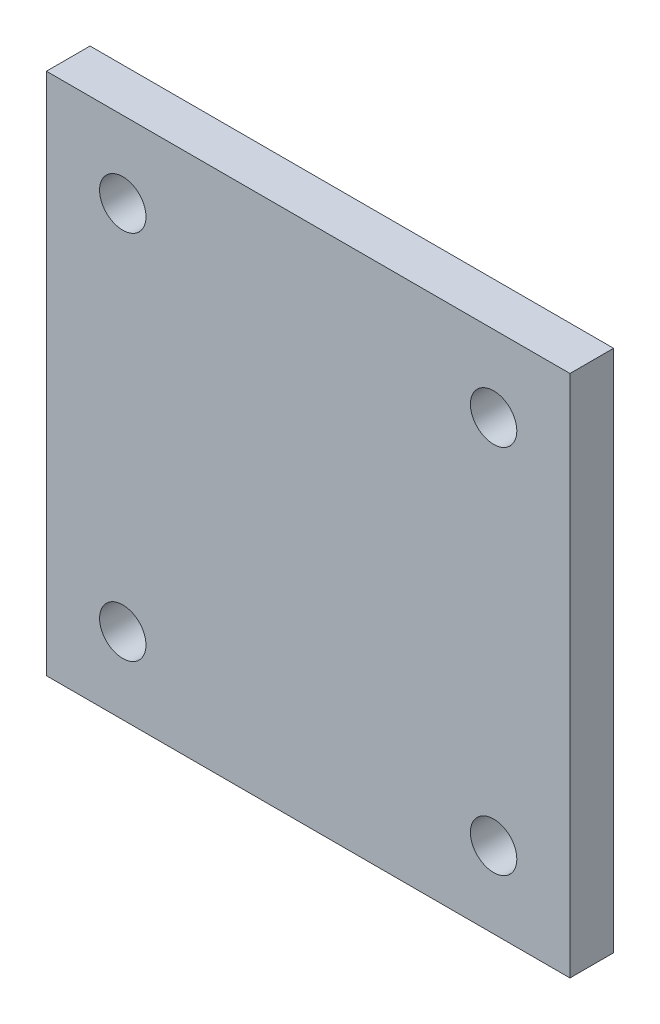
ISO-10303-21;
HEADER;
FILE_DESCRIPTION(('STEP AP214'),'2;1');
FILE_NAME('part.step','',(''),(''),'','','');
FILE_SCHEMA(('AUTOMOTIVE_DESIGN { 1 0 10303 214 1 1 1 1 }'));
ENDSEC;
DATA;
#1=APPLICATION_CONTEXT('core data for automotive mechanical design processes');
#2=APPLICATION_PROTOCOL_DEFINITION('international standard','automotive_design',2000,#1);
#3=PRODUCT_CONTEXT('',#1,'mechanical');
#4=PRODUCT('Part','Part','',(#3));
#5=PRODUCT_RELATED_PRODUCT_CATEGORY('part','',(#4));
#6=PRODUCT_DEFINITION_FORMATION('','',#4);
#7=PRODUCT_DEFINITION_CONTEXT('part definition',#1,'design');
#8=PRODUCT_DEFINITION('design','',#6,#7);
#9=PRODUCT_DEFINITION_SHAPE('','',#8);
#10=(LENGTH_UNIT() NAMED_UNIT(*) SI_UNIT(.MILLI.,.METRE.));
#11=(NAMED_UNIT(*) PLANE_ANGLE_UNIT() SI_UNIT($,.RADIAN.));
#12=(NAMED_UNIT(*) SI_UNIT($,.STERADIAN.) SOLID_ANGLE_UNIT());
#13=UNCERTAINTY_MEASURE_WITH_UNIT(LENGTH_MEASURE(1.E-05),#10,'distance_accuracy_value','');
#14=(GEOMETRIC_REPRESENTATION_CONTEXT(3) GLOBAL_UNCERTAINTY_ASSIGNED_CONTEXT((#13)) GLOBAL_UNIT_ASSIGNED_CONTEXT((#10,
#11,#12)) REPRESENTATION_CONTEXT('',''));
#15=CARTESIAN_POINT('',(0.,0.,0.));
#16=DIRECTION('',(0.,0.,1.));
#17=DIRECTION('',(1.,0.,0.));
#18=AXIS2_PLACEMENT_3D('',#15,#16,#17);
#19=CARTESIAN_POINT('',(38.1,-38.1,6.35));
#20=DIRECTION('',(-1.,0.,0.));
#21=DIRECTION('',(0.,0.,1.));
#22=AXIS2_PLACEMENT_3D('',#19,#20,#21);
#23=PLANE('',#22);
#24=DIRECTION('',(0.,1.,0.));
#25=VECTOR('',#24,1.);
#26=CARTESIAN_POINT('',(38.1,-38.1,0.));
#27=LINE('',#26,#25);
#28=CARTESIAN_POINT('',(38.1,-38.1,0.));
#29=VERTEX_POINT('',#28);
#30=CARTESIAN_POINT('',(38.1,38.1,0.));
#31=VERTEX_POINT('',#30);
#32=EDGE_CURVE('E97',#29,#31,#27,.T.);
#33=ORIENTED_EDGE('',*,*,#32,.T.);
#34=DIRECTION('',(0.,0.,-1.));
#35=VECTOR('',#34,1.);
#36=CARTESIAN_POINT('',(38.1,38.1,6.35));
#37=LINE('',#36,#35);
#38=CARTESIAN_POINT('',(38.1,38.1,6.35));
#39=VERTEX_POINT('',#38);
#40=EDGE_CURVE('E11',#39,#31,#37,.T.);
#41=ORIENTED_EDGE('',*,*,#40,.F.);
#42=DIRECTION('',(0.,1.,0.));
#43=VECTOR('',#42,1.);
#44=CARTESIAN_POINT('',(38.1,-38.1,6.35));
#45=LINE('',#44,#43);
#46=CARTESIAN_POINT('',(38.1,-38.1,6.35));
#47=VERTEX_POINT('',#46);
#48=EDGE_CURVE('E85',#47,#39,#45,.T.);
#49=ORIENTED_EDGE('',*,*,#48,.F.);
#50=DIRECTION('',(0.,0.,-1.));
#51=VECTOR('',#50,1.);
#52=CARTESIAN_POINT('',(38.1,-38.1,6.35));
#53=LINE('',#52,#51);
#54=EDGE_CURVE('E93',#47,#29,#53,.T.);
#55=ORIENTED_EDGE('',*,*,#54,.T.);
#56=EDGE_LOOP('',(#33,#41,#49,#55));
#57=FACE_BOUND('',#56,.T.);
#58=ADVANCED_FACE('F34',(#57),#23,.F.);
#59=CARTESIAN_POINT('',(-38.1,38.1,6.35));
#60=DIRECTION('',(0.,-1.,0.));
#61=DIRECTION('',(0.,0.,-1.));
#62=AXIS2_PLACEMENT_3D('',#59,#60,#61);
#63=PLANE('',#62);
#64=DIRECTION('',(-1.,0.,0.));
#65=VECTOR('',#64,1.);
#66=CARTESIAN_POINT('',(-38.1,38.1,0.));
#67=LINE('',#66,#65);
#68=CARTESIAN_POINT('',(-38.1,38.1,0.));
#69=VERTEX_POINT('',#68);
#70=EDGE_CURVE('E89',#31,#69,#67,.T.);
#71=ORIENTED_EDGE('',*,*,#70,.T.);
#72=DIRECTION('',(0.,0.,-1.));
#73=VECTOR('',#72,1.);
#74=CARTESIAN_POINT('',(-38.1,38.1,6.35));
#75=LINE('',#74,#73);
#76=CARTESIAN_POINT('',(-38.1,38.1,6.35));
#77=VERTEX_POINT('',#76);
#78=EDGE_CURVE('E42',#77,#69,#75,.T.);
#79=ORIENTED_EDGE('',*,*,#78,.F.);
#80=DIRECTION('',(-1.,0.,0.));
#81=VECTOR('',#80,1.);
#82=CARTESIAN_POINT('',(-38.1,38.1,6.35));
#83=LINE('',#82,#81);
#84=EDGE_CURVE('E80',#39,#77,#83,.T.);
#85=ORIENTED_EDGE('',*,*,#84,.F.);
#86=ORIENTED_EDGE('',*,*,#40,.T.);
#87=EDGE_LOOP('',(#71,#79,#85,#86));
#88=FACE_BOUND('',#87,.T.);
#89=ADVANCED_FACE('F88',(#88),#63,.F.);
#90=CARTESIAN_POINT('',(-38.1,-38.1,6.35));
#91=DIRECTION('',(1.,0.,0.));
#92=DIRECTION('',(0.,0.,-1.));
#93=AXIS2_PLACEMENT_3D('',#90,#91,#92);
#94=PLANE('',#93);
#95=DIRECTION('',(0.,-1.,0.));
#96=VECTOR('',#95,1.);
#97=CARTESIAN_POINT('',(-38.1,-38.1,0.));
#98=LINE('',#97,#96);
#99=CARTESIAN_POINT('',(-38.1,-38.1,0.));
#100=VERTEX_POINT('',#99);
#101=EDGE_CURVE('E67',#69,#100,#98,.T.);
#102=ORIENTED_EDGE('',*,*,#101,.T.);
#103=DIRECTION('',(0.,0.,-1.));
#104=VECTOR('',#103,1.);
#105=CARTESIAN_POINT('',(-38.1,-38.1,6.35));
#106=LINE('',#105,#104);
#107=CARTESIAN_POINT('',(-38.1,-38.1,6.35));
#108=VERTEX_POINT('',#107);
#109=EDGE_CURVE('E90',#108,#100,#106,.T.);
#110=ORIENTED_EDGE('',*,*,#109,.F.);
#111=DIRECTION('',(0.,-1.,0.));
#112=VECTOR('',#111,1.);
#113=CARTESIAN_POINT('',(-38.1,-38.1,6.35));
#114=LINE('',#113,#112);
#115=EDGE_CURVE('E83',#77,#108,#114,.T.);
#116=ORIENTED_EDGE('',*,*,#115,.F.);
#117=ORIENTED_EDGE('',*,*,#78,.T.);
#118=EDGE_LOOP('',(#102,#110,#116,#117));
#119=FACE_BOUND('',#118,.T.);
#120=ADVANCED_FACE('F91',(#119),#94,.F.);
#121=CARTESIAN_POINT('',(-38.1,-38.1,6.35));
#122=DIRECTION('',(0.,1.,0.));
#123=DIRECTION('',(0.,0.,1.));
#124=AXIS2_PLACEMENT_3D('',#121,#122,#123);
#125=PLANE('',#124);
#126=DIRECTION('',(1.,0.,0.));
#127=VECTOR('',#126,1.);
#128=CARTESIAN_POINT('',(-38.1,-38.1,0.));
#129=LINE('',#128,#127);
#130=EDGE_CURVE('E73',#100,#29,#129,.T.);
#131=ORIENTED_EDGE('',*,*,#130,.T.);
#132=ORIENTED_EDGE('',*,*,#54,.F.);
#133=DIRECTION('',(1.,0.,0.));
#134=VECTOR('',#133,1.);
#135=CARTESIAN_POINT('',(-38.1,-38.1,6.35));
#136=LINE('',#135,#134);
#137=EDGE_CURVE('E50',#108,#47,#136,.T.);
#138=ORIENTED_EDGE('',*,*,#137,.F.);
#139=ORIENTED_EDGE('',*,*,#109,.T.);
#140=EDGE_LOOP('',(#131,#132,#138,#139));
#141=FACE_BOUND('',#140,.T.);
#142=ADVANCED_FACE('F105',(#141),#125,.F.);
#143=CARTESIAN_POINT('',(38.1,38.1,6.35));
#144=DIRECTION('',(0.,0.,-1.));
#145=DIRECTION('',(-1.,0.,0.));
#146=AXIS2_PLACEMENT_3D('',#143,#144,#145);
#147=PLANE('',#146);
#148=CARTESIAN_POINT('',(-26.9875,26.9875,6.35));
#149=DIRECTION('',(0.,0.,1.));
#150=DIRECTION('',(1.,0.,0.));
#151=AXIS2_PLACEMENT_3D('',#148,#149,#150);
#152=CIRCLE('',#151,3.37819999999999);
#153=CARTESIAN_POINT('',(-23.6093,26.9875,6.35));
#154=VERTEX_POINT('',#153);
#155=EDGE_CURVE('E131',#154,#154,#152,.T.);
#156=ORIENTED_EDGE('',*,*,#155,.F.);
#157=EDGE_LOOP('',(#156));
#158=FACE_BOUND('',#157,.T.);
#159=CARTESIAN_POINT('',(26.9875,26.9875,6.35));
#160=DIRECTION('',(0.,0.,1.));
#161=DIRECTION('',(1.,0.,0.));
#162=AXIS2_PLACEMENT_3D('',#159,#160,#161);
#163=CIRCLE('',#162,3.37819999999999);
#164=CARTESIAN_POINT('',(30.3657,26.9875,6.35));
#165=VERTEX_POINT('',#164);
#166=EDGE_CURVE('E125',#165,#165,#163,.T.);
#167=ORIENTED_EDGE('',*,*,#166,.F.);
#168=EDGE_LOOP('',(#167));
#169=FACE_BOUND('',#168,.T.);
#170=CARTESIAN_POINT('',(26.9875,-26.9875,6.35));
#171=DIRECTION('',(0.,0.,1.));
#172=DIRECTION('',(1.,0.,0.));
#173=AXIS2_PLACEMENT_3D('',#170,#171,#172);
#174=CIRCLE('',#173,3.37819999999999);
#175=CARTESIAN_POINT('',(30.3657,-26.9875,6.35));
#176=VERTEX_POINT('',#175);
#177=EDGE_CURVE('E119',#176,#176,#174,.T.);
#178=ORIENTED_EDGE('',*,*,#177,.F.);
#179=EDGE_LOOP('',(#178));
#180=FACE_BOUND('',#179,.T.);
#181=CARTESIAN_POINT('',(-26.9875,-26.9875,6.35));
#182=DIRECTION('',(0.,0.,1.));
#183=DIRECTION('',(1.,0.,0.));
#184=AXIS2_PLACEMENT_3D('',#181,#182,#183);
#185=CIRCLE('',#184,3.37819999999999);
#186=CARTESIAN_POINT('',(-23.6093,-26.9875,6.35));
#187=VERTEX_POINT('',#186);
#188=EDGE_CURVE('E113',#187,#187,#185,.T.);
#189=ORIENTED_EDGE('',*,*,#188,.F.);
#190=EDGE_LOOP('',(#189));
#191=FACE_BOUND('',#190,.T.);
#192=ORIENTED_EDGE('',*,*,#48,.T.);
#193=ORIENTED_EDGE('',*,*,#84,.T.);
#194=ORIENTED_EDGE('',*,*,#115,.T.);
#195=ORIENTED_EDGE('',*,*,#137,.T.);
#196=EDGE_LOOP('',(#192,#193,#194,#195));
#197=FACE_BOUND('',#196,.T.);
#198=ADVANCED_FACE('F81',(#158,#169,#180,#191,#197),#147,.F.);
#199=CARTESIAN_POINT('',(38.1,38.1,0.));
#200=DIRECTION('',(0.,0.,-1.));
#201=DIRECTION('',(-1.,0.,0.));
#202=AXIS2_PLACEMENT_3D('',#199,#200,#201);
#203=PLANE('',#202);
#204=CARTESIAN_POINT('',(-26.9875,26.9875,0.));
#205=DIRECTION('',(0.,0.,1.));
#206=DIRECTION('',(1.,0.,0.));
#207=AXIS2_PLACEMENT_3D('',#204,#205,#206);
#208=CIRCLE('',#207,3.3782);
#209=CARTESIAN_POINT('',(-23.6093,26.9875,0.));
#210=VERTEX_POINT('',#209);
#211=EDGE_CURVE('E128',#210,#210,#208,.T.);
#212=ORIENTED_EDGE('',*,*,#211,.T.);
#213=EDGE_LOOP('',(#212));
#214=FACE_BOUND('',#213,.T.);
#215=CARTESIAN_POINT('',(26.9875,26.9875,0.));
#216=DIRECTION('',(0.,0.,1.));
#217=DIRECTION('',(1.,0.,0.));
#218=AXIS2_PLACEMENT_3D('',#215,#216,#217);
#219=CIRCLE('',#218,3.3782);
#220=CARTESIAN_POINT('',(30.3657,26.9875,0.));
#221=VERTEX_POINT('',#220);
#222=EDGE_CURVE('E122',#221,#221,#219,.T.);
#223=ORIENTED_EDGE('',*,*,#222,.T.);
#224=EDGE_LOOP('',(#223));
#225=FACE_BOUND('',#224,.T.);
#226=CARTESIAN_POINT('',(26.9875,-26.9875,0.));
#227=DIRECTION('',(0.,0.,1.));
#228=DIRECTION('',(1.,0.,0.));
#229=AXIS2_PLACEMENT_3D('',#226,#227,#228);
#230=CIRCLE('',#229,3.3782);
#231=CARTESIAN_POINT('',(30.3657,-26.9875,0.));
#232=VERTEX_POINT('',#231);
#233=EDGE_CURVE('E116',#232,#232,#230,.T.);
#234=ORIENTED_EDGE('',*,*,#233,.T.);
#235=EDGE_LOOP('',(#234));
#236=FACE_BOUND('',#235,.T.);
#237=CARTESIAN_POINT('',(-26.9875,-26.9875,0.));
#238=DIRECTION('',(0.,0.,1.));
#239=DIRECTION('',(1.,0.,0.));
#240=AXIS2_PLACEMENT_3D('',#237,#238,#239);
#241=CIRCLE('',#240,3.3782);
#242=CARTESIAN_POINT('',(-23.6093,-26.9875,0.));
#243=VERTEX_POINT('',#242);
#244=EDGE_CURVE('E100',#243,#243,#241,.T.);
#245=ORIENTED_EDGE('',*,*,#244,.T.);
#246=EDGE_LOOP('',(#245));
#247=FACE_BOUND('',#246,.T.);
#248=ORIENTED_EDGE('',*,*,#32,.F.);
#249=ORIENTED_EDGE('',*,*,#130,.F.);
#250=ORIENTED_EDGE('',*,*,#101,.F.);
#251=ORIENTED_EDGE('',*,*,#70,.F.);
#252=EDGE_LOOP('',(#248,#249,#250,#251));
#253=FACE_BOUND('',#252,.T.);
#254=ADVANCED_FACE('F108',(#214,#225,#236,#247,#253),#203,.T.);
#255=CARTESIAN_POINT('',(-26.9875,-26.9875,6.35));
#256=DIRECTION('',(0.,0.,1.));
#257=DIRECTION('',(1.,0.,0.));
#258=AXIS2_PLACEMENT_3D('',#255,#256,#257);
#259=CYLINDRICAL_SURFACE('',#258,3.37819999999999);
#260=ORIENTED_EDGE('',*,*,#244,.F.);
#261=EDGE_LOOP('',(#260));
#262=FACE_BOUND('',#261,.T.);
#263=ORIENTED_EDGE('',*,*,#188,.T.);
#264=EDGE_LOOP('',(#263));
#265=FACE_BOUND('',#264,.T.);
#266=ADVANCED_FACE('F146',(#262,#265),#259,.F.);
#267=CARTESIAN_POINT('',(26.9875,-26.9875,6.35));
#268=DIRECTION('',(0.,0.,1.));
#269=DIRECTION('',(1.,0.,0.));
#270=AXIS2_PLACEMENT_3D('',#267,#268,#269);
#271=CYLINDRICAL_SURFACE('',#270,3.37819999999999);
#272=ORIENTED_EDGE('',*,*,#233,.F.);
#273=EDGE_LOOP('',(#272));
#274=FACE_BOUND('',#273,.T.);
#275=ORIENTED_EDGE('',*,*,#177,.T.);
#276=EDGE_LOOP('',(#275));
#277=FACE_BOUND('',#276,.T.);
#278=ADVANCED_FACE('F148',(#274,#277),#271,.F.);
#279=CARTESIAN_POINT('',(26.9875,26.9875,6.35));
#280=DIRECTION('',(0.,0.,1.));
#281=DIRECTION('',(1.,0.,0.));
#282=AXIS2_PLACEMENT_3D('',#279,#280,#281);
#283=CYLINDRICAL_SURFACE('',#282,3.37819999999999);
#284=ORIENTED_EDGE('',*,*,#222,.F.);
#285=EDGE_LOOP('',(#284));
#286=FACE_BOUND('',#285,.T.);
#287=ORIENTED_EDGE('',*,*,#166,.T.);
#288=EDGE_LOOP('',(#287));
#289=FACE_BOUND('',#288,.T.);
#290=ADVANCED_FACE('F155',(#286,#289),#283,.F.);
#291=CARTESIAN_POINT('',(-26.9875,26.9875,6.35));
#292=DIRECTION('',(0.,0.,1.));
#293=DIRECTION('',(1.,0.,0.));
#294=AXIS2_PLACEMENT_3D('',#291,#292,#293);
#295=CYLINDRICAL_SURFACE('',#294,3.37819999999999);
#296=ORIENTED_EDGE('',*,*,#211,.F.);
#297=EDGE_LOOP('',(#296));
#298=FACE_BOUND('',#297,.T.);
#299=ORIENTED_EDGE('',*,*,#155,.T.);
#300=EDGE_LOOP('',(#299));
#301=FACE_BOUND('',#300,.T.);
#302=ADVANCED_FACE('F135',(#298,#301),#295,.F.);
#303=CLOSED_SHELL('',(#58,#89,#120,#142,#198,#254,#266,#278,#290,#302));
#304=MANIFOLD_SOLID_BREP('B2',#303);
#305=ADVANCED_BREP_SHAPE_REPRESENTATION('',(#18,#304),#14);
#306=SHAPE_DEFINITION_REPRESENTATION(#9,#305);
ENDSEC;
END-ISO-10303-21;
